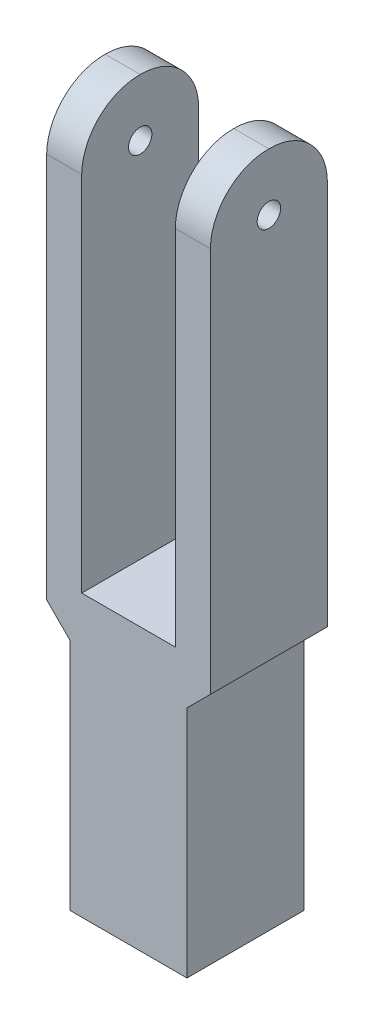
ISO-10303-21;
HEADER;
FILE_DESCRIPTION(('STEP AP214'),'2;1');
FILE_NAME('part.step','',(''),(''),'','','');
FILE_SCHEMA(('AUTOMOTIVE_DESIGN { 1 0 10303 214 1 1 1 1 }'));
ENDSEC;
DATA;
#1=APPLICATION_CONTEXT('core data for automotive mechanical design processes');
#2=APPLICATION_PROTOCOL_DEFINITION('international standard','automotive_design',2000,#1);
#3=PRODUCT_CONTEXT('',#1,'mechanical');
#4=PRODUCT('Part','Part','',(#3));
#5=PRODUCT_RELATED_PRODUCT_CATEGORY('part','',(#4));
#6=PRODUCT_DEFINITION_FORMATION('','',#4);
#7=PRODUCT_DEFINITION_CONTEXT('part definition',#1,'design');
#8=PRODUCT_DEFINITION('design','',#6,#7);
#9=PRODUCT_DEFINITION_SHAPE('','',#8);
#10=(LENGTH_UNIT() NAMED_UNIT(*) SI_UNIT(.MILLI.,.METRE.));
#11=(NAMED_UNIT(*) PLANE_ANGLE_UNIT() SI_UNIT($,.RADIAN.));
#12=(NAMED_UNIT(*) SI_UNIT($,.STERADIAN.) SOLID_ANGLE_UNIT());
#13=UNCERTAINTY_MEASURE_WITH_UNIT(LENGTH_MEASURE(1.E-05),#10,'distance_accuracy_value','');
#14=(GEOMETRIC_REPRESENTATION_CONTEXT(3) GLOBAL_UNCERTAINTY_ASSIGNED_CONTEXT((#13)) GLOBAL_UNIT_ASSIGNED_CONTEXT((#10,
#11,#12)) REPRESENTATION_CONTEXT('',''));
#15=CARTESIAN_POINT('',(0.,0.,0.));
#16=DIRECTION('',(0.,0.,1.));
#17=DIRECTION('',(1.,0.,0.));
#18=AXIS2_PLACEMENT_3D('',#15,#16,#17);
#19=CARTESIAN_POINT('',(3.5,30.,2.5));
#20=DIRECTION('',(-1.,0.,0.));
#21=DIRECTION('',(0.,0.,1.));
#22=AXIS2_PLACEMENT_3D('',#19,#20,#21);
#23=PLANE('',#22);
#24=CARTESIAN_POINT('',(3.5,27.5,0.));
#25=DIRECTION('',(1.,0.,0.));
#26=DIRECTION('',(0.,0.,-1.));
#27=AXIS2_PLACEMENT_3D('',#24,#25,#26);
#28=CIRCLE('',#27,0.5);
#29=CARTESIAN_POINT('',(3.5,27.5,-0.500000000000004));
#30=VERTEX_POINT('',#29);
#31=EDGE_CURVE('E447',#30,#30,#28,.T.);
#32=ORIENTED_EDGE('',*,*,#31,.F.);
#33=EDGE_LOOP('',(#32));
#34=FACE_BOUND('',#33,.T.);
#35=CARTESIAN_POINT('',(3.5,27.4738892377842,-0.0261107622158117));
#36=DIRECTION('',(-1.,0.,0.));
#37=DIRECTION('',(0.,0.,1.));
#38=AXIS2_PLACEMENT_3D('',#35,#36,#37);
#39=CIRCLE('',#38,2.47402702748535);
#40=CARTESIAN_POINT('',(3.5,29.9477784755684,0.));
#41=VERTEX_POINT('',#40);
#42=CARTESIAN_POINT('',(3.5,27.5,-2.50000000000001));
#43=VERTEX_POINT('',#42);
#44=EDGE_CURVE('E152',#41,#43,#39,.T.);
#45=ORIENTED_EDGE('',*,*,#44,.F.);
#46=CARTESIAN_POINT('',(3.5,27.4738892377841,0.0261107622157451));
#47=DIRECTION('',(-1.,0.,0.));
#48=DIRECTION('',(0.,0.,1.));
#49=AXIS2_PLACEMENT_3D('',#46,#47,#48);
#50=CIRCLE('',#49,2.4740270274854);
#51=CARTESIAN_POINT('',(3.5,27.5,2.5));
#52=VERTEX_POINT('',#51);
#53=EDGE_CURVE('E154',#52,#41,#50,.T.);
#54=ORIENTED_EDGE('',*,*,#53,.F.);
#55=DIRECTION('',(0.,-1.,0.));
#56=VECTOR('',#55,1.);
#57=CARTESIAN_POINT('',(3.5,30.,2.5));
#58=LINE('',#57,#56);
#59=CARTESIAN_POINT('',(3.5,11.,2.5));
#60=VERTEX_POINT('',#59);
#61=EDGE_CURVE('E236',#52,#60,#58,.T.);
#62=ORIENTED_EDGE('',*,*,#61,.T.);
#63=DIRECTION('',(0.,0.,1.));
#64=VECTOR('',#63,1.);
#65=CARTESIAN_POINT('',(3.5,11.,-2.501));
#66=LINE('',#65,#64);
#67=CARTESIAN_POINT('',(3.5,11.,-2.5));
#68=VERTEX_POINT('',#67);
#69=EDGE_CURVE('E174',#68,#60,#66,.T.);
#70=ORIENTED_EDGE('',*,*,#69,.F.);
#71=DIRECTION('',(0.,-1.,0.));
#72=VECTOR('',#71,1.);
#73=CARTESIAN_POINT('',(3.5,30.,-2.5));
#74=LINE('',#73,#72);
#75=EDGE_CURVE('E234',#43,#68,#74,.T.);
#76=ORIENTED_EDGE('',*,*,#75,.F.);
#77=EDGE_LOOP('',(#45,#54,#62,#70,#76));
#78=FACE_BOUND('',#77,.T.);
#79=ADVANCED_FACE('F32',(#34,#78),#23,.F.);
#80=CARTESIAN_POINT('',(-3.5,30.,2.5));
#81=DIRECTION('',(1.,0.,0.));
#82=DIRECTION('',(0.,0.,-1.));
#83=AXIS2_PLACEMENT_3D('',#80,#81,#82);
#84=PLANE('',#83);
#85=CARTESIAN_POINT('',(-3.5,27.5,0.));
#86=DIRECTION('',(1.,0.,0.));
#87=DIRECTION('',(0.,0.,-1.));
#88=AXIS2_PLACEMENT_3D('',#85,#86,#87);
#89=CIRCLE('',#88,0.5);
#90=CARTESIAN_POINT('',(-3.5,27.5,-0.500000000000004));
#91=VERTEX_POINT('',#90);
#92=EDGE_CURVE('E451',#91,#91,#89,.T.);
#93=ORIENTED_EDGE('',*,*,#92,.T.);
#94=EDGE_LOOP('',(#93));
#95=FACE_BOUND('',#94,.T.);
#96=DIRECTION('',(0.,-1.,0.));
#97=VECTOR('',#96,1.);
#98=CARTESIAN_POINT('',(-3.5,30.,2.5));
#99=LINE('',#98,#97);
#100=CARTESIAN_POINT('',(-3.5,27.5,2.5));
#101=VERTEX_POINT('',#100);
#102=CARTESIAN_POINT('',(-3.5,11.,2.5));
#103=VERTEX_POINT('',#102);
#104=EDGE_CURVE('E151',#101,#103,#99,.T.);
#105=ORIENTED_EDGE('',*,*,#104,.F.);
#106=CARTESIAN_POINT('',(-3.5,27.4738892377841,0.0261107622157451));
#107=DIRECTION('',(-1.,0.,0.));
#108=DIRECTION('',(0.,0.,1.));
#109=AXIS2_PLACEMENT_3D('',#106,#107,#108);
#110=CIRCLE('',#109,2.4740270274854);
#111=CARTESIAN_POINT('',(-3.5,29.9477784755684,0.));
#112=VERTEX_POINT('',#111);
#113=EDGE_CURVE('E134',#101,#112,#110,.T.);
#114=ORIENTED_EDGE('',*,*,#113,.T.);
#115=CARTESIAN_POINT('',(-3.5,27.4738892377842,-0.0261107622158117));
#116=DIRECTION('',(-1.,0.,0.));
#117=DIRECTION('',(0.,0.,1.));
#118=AXIS2_PLACEMENT_3D('',#115,#116,#117);
#119=CIRCLE('',#118,2.47402702748535);
#120=CARTESIAN_POINT('',(-3.5,27.5,-2.50000000000001));
#121=VERTEX_POINT('',#120);
#122=EDGE_CURVE('E142',#112,#121,#119,.T.);
#123=ORIENTED_EDGE('',*,*,#122,.T.);
#124=DIRECTION('',(0.,-1.,0.));
#125=VECTOR('',#124,1.);
#126=CARTESIAN_POINT('',(-3.5,30.,-2.5));
#127=LINE('',#126,#125);
#128=CARTESIAN_POINT('',(-3.5,11.,-2.5));
#129=VERTEX_POINT('',#128);
#130=EDGE_CURVE('E232',#121,#129,#127,.T.);
#131=ORIENTED_EDGE('',*,*,#130,.T.);
#132=DIRECTION('',(0.,0.,1.));
#133=VECTOR('',#132,1.);
#134=CARTESIAN_POINT('',(-3.5,11.,-2.501));
#135=LINE('',#134,#133);
#136=EDGE_CURVE('E182',#129,#103,#135,.T.);
#137=ORIENTED_EDGE('',*,*,#136,.T.);
#138=EDGE_LOOP('',(#105,#114,#123,#131,#137));
#139=FACE_BOUND('',#138,.T.);
#140=ADVANCED_FACE('F34',(#95,#139),#84,.F.);
#141=CARTESIAN_POINT('',(3.5,30.,2.5));
#142=DIRECTION('',(0.,0.,-1.));
#143=DIRECTION('',(-1.,0.,0.));
#144=AXIS2_PLACEMENT_3D('',#141,#142,#143);
#145=PLANE('',#144);
#146=ORIENTED_EDGE('',*,*,#61,.F.);
#147=DIRECTION('',(1.,0.,0.));
#148=VECTOR('',#147,1.);
#149=CARTESIAN_POINT('',(-3.5,27.5,2.5));
#150=LINE('',#149,#148);
#151=CARTESIAN_POINT('',(2.,27.5,2.5));
#152=VERTEX_POINT('',#151);
#153=EDGE_CURVE('E165',#152,#52,#150,.T.);
#154=ORIENTED_EDGE('',*,*,#153,.F.);
#155=DIRECTION('',(0.,1.,0.));
#156=VECTOR('',#155,1.);
#157=CARTESIAN_POINT('',(2.,12.,2.5));
#158=LINE('',#157,#156);
#159=CARTESIAN_POINT('',(2.,12.,2.5));
#160=VERTEX_POINT('',#159);
#161=EDGE_CURVE('E204',#160,#152,#158,.T.);
#162=ORIENTED_EDGE('',*,*,#161,.F.);
#163=DIRECTION('',(1.,0.,0.));
#164=VECTOR('',#163,1.);
#165=CARTESIAN_POINT('',(2.,12.,2.5));
#166=LINE('',#165,#164);
#167=CARTESIAN_POINT('',(-2.,12.,2.5));
#168=VERTEX_POINT('',#167);
#169=EDGE_CURVE('E187',#168,#160,#166,.T.);
#170=ORIENTED_EDGE('',*,*,#169,.F.);
#171=DIRECTION('',(0.,1.,0.));
#172=VECTOR('',#171,1.);
#173=CARTESIAN_POINT('',(-2.,12.,2.5));
#174=LINE('',#173,#172);
#175=CARTESIAN_POINT('',(-2.,27.5,2.5));
#176=VERTEX_POINT('',#175);
#177=EDGE_CURVE('E196',#168,#176,#174,.T.);
#178=ORIENTED_EDGE('',*,*,#177,.T.);
#179=EDGE_CURVE('E162',#101,#176,#150,.T.);
#180=ORIENTED_EDGE('',*,*,#179,.F.);
#181=ORIENTED_EDGE('',*,*,#104,.T.);
#182=DIRECTION('',(-0.707106781186548,0.707106781186547,0.));
#183=VECTOR('',#182,1.);
#184=CARTESIAN_POINT('',(-2.5,10.,2.5));
#185=LINE('',#184,#183);
#186=CARTESIAN_POINT('',(-2.5,10.,2.5));
#187=VERTEX_POINT('',#186);
#188=EDGE_CURVE('E179',#187,#103,#185,.T.);
#189=ORIENTED_EDGE('',*,*,#188,.F.);
#190=DIRECTION('',(0.,-1.,0.));
#191=VECTOR('',#190,1.);
#192=CARTESIAN_POINT('',(-2.5,10.,2.5));
#193=LINE('',#192,#191);
#194=CARTESIAN_POINT('',(-2.5,0.,2.5));
#195=VERTEX_POINT('',#194);
#196=EDGE_CURVE('E222',#187,#195,#193,.T.);
#197=ORIENTED_EDGE('',*,*,#196,.T.);
#198=DIRECTION('',(1.,0.,0.));
#199=VECTOR('',#198,1.);
#200=CARTESIAN_POINT('',(3.5,0.,2.5));
#201=LINE('',#200,#199);
#202=CARTESIAN_POINT('',(2.5,0.,2.5));
#203=VERTEX_POINT('',#202);
#204=EDGE_CURVE('E225',#195,#203,#201,.T.);
#205=ORIENTED_EDGE('',*,*,#204,.T.);
#206=DIRECTION('',(0.,-1.,0.));
#207=VECTOR('',#206,1.);
#208=CARTESIAN_POINT('',(2.5,10.,2.5));
#209=LINE('',#208,#207);
#210=CARTESIAN_POINT('',(2.5,10.,2.5));
#211=VERTEX_POINT('',#210);
#212=EDGE_CURVE('E211',#211,#203,#209,.T.);
#213=ORIENTED_EDGE('',*,*,#212,.F.);
#214=DIRECTION('',(-0.707106781186548,-0.707106781186547,0.));
#215=VECTOR('',#214,1.);
#216=CARTESIAN_POINT('',(2.5,10.,2.5));
#217=LINE('',#216,#215);
#218=EDGE_CURVE('E172',#60,#211,#217,.T.);
#219=ORIENTED_EDGE('',*,*,#218,.F.);
#220=EDGE_LOOP('',(#146,#154,#162,#170,#178,#180,#181,#189,#197,#205,#213,#219));
#221=FACE_BOUND('',#220,.T.);
#222=ADVANCED_FACE('F254',(#221),#145,.F.);
#223=CARTESIAN_POINT('',(3.5,30.,-2.5));
#224=DIRECTION('',(0.,0.,1.));
#225=DIRECTION('',(1.,0.,0.));
#226=AXIS2_PLACEMENT_3D('',#223,#224,#225);
#227=PLANE('',#226);
#228=ORIENTED_EDGE('',*,*,#130,.F.);
#229=DIRECTION('',(1.,0.,0.));
#230=VECTOR('',#229,1.);
#231=CARTESIAN_POINT('',(-3.5,27.5,-2.50000000000001));
#232=LINE('',#231,#230);
#233=CARTESIAN_POINT('',(-2.,27.5,-2.50000000000001));
#234=VERTEX_POINT('',#233);
#235=EDGE_CURVE('E145',#121,#234,#232,.T.);
#236=ORIENTED_EDGE('',*,*,#235,.T.);
#237=DIRECTION('',(0.,1.,0.));
#238=VECTOR('',#237,1.);
#239=CARTESIAN_POINT('',(-2.,12.,-2.5));
#240=LINE('',#239,#238);
#241=CARTESIAN_POINT('',(-2.,12.,-2.5));
#242=VERTEX_POINT('',#241);
#243=EDGE_CURVE('E197',#242,#234,#240,.T.);
#244=ORIENTED_EDGE('',*,*,#243,.F.);
#245=DIRECTION('',(-1.,0.,0.));
#246=VECTOR('',#245,1.);
#247=CARTESIAN_POINT('',(2.,12.,-2.5));
#248=LINE('',#247,#246);
#249=CARTESIAN_POINT('',(2.,12.,-2.5));
#250=VERTEX_POINT('',#249);
#251=EDGE_CURVE('E193',#250,#242,#248,.T.);
#252=ORIENTED_EDGE('',*,*,#251,.F.);
#253=DIRECTION('',(0.,1.,0.));
#254=VECTOR('',#253,1.);
#255=CARTESIAN_POINT('',(2.,12.,-2.5));
#256=LINE('',#255,#254);
#257=CARTESIAN_POINT('',(2.,27.500000000001,-2.5));
#258=VERTEX_POINT('',#257);
#259=EDGE_CURVE('E201',#250,#258,#256,.T.);
#260=ORIENTED_EDGE('',*,*,#259,.T.);
#261=EDGE_CURVE('E56',#258,#43,#232,.T.);
#262=ORIENTED_EDGE('',*,*,#261,.T.);
#263=ORIENTED_EDGE('',*,*,#75,.T.);
#264=DIRECTION('',(0.707106781186548,0.707106781186547,0.));
#265=VECTOR('',#264,1.);
#266=CARTESIAN_POINT('',(2.5,10.,-2.5));
#267=LINE('',#266,#265);
#268=CARTESIAN_POINT('',(2.5,10.,-2.5));
#269=VERTEX_POINT('',#268);
#270=EDGE_CURVE('E169',#269,#68,#267,.T.);
#271=ORIENTED_EDGE('',*,*,#270,.F.);
#272=DIRECTION('',(0.,-1.,0.));
#273=VECTOR('',#272,1.);
#274=CARTESIAN_POINT('',(2.5,10.,-2.5));
#275=LINE('',#274,#273);
#276=CARTESIAN_POINT('',(2.5,0.,-2.5));
#277=VERTEX_POINT('',#276);
#278=EDGE_CURVE('E213',#269,#277,#275,.T.);
#279=ORIENTED_EDGE('',*,*,#278,.T.);
#280=DIRECTION('',(-1.,0.,0.));
#281=VECTOR('',#280,1.);
#282=CARTESIAN_POINT('',(3.5,0.,-2.5));
#283=LINE('',#282,#281);
#284=CARTESIAN_POINT('',(-2.5,0.,-2.5));
#285=VERTEX_POINT('',#284);
#286=EDGE_CURVE('E230',#277,#285,#283,.T.);
#287=ORIENTED_EDGE('',*,*,#286,.T.);
#288=DIRECTION('',(0.,-1.,0.));
#289=VECTOR('',#288,1.);
#290=CARTESIAN_POINT('',(-2.5,10.,-2.5));
#291=LINE('',#290,#289);
#292=CARTESIAN_POINT('',(-2.5,10.,-2.5));
#293=VERTEX_POINT('',#292);
#294=EDGE_CURVE('E220',#293,#285,#291,.T.);
#295=ORIENTED_EDGE('',*,*,#294,.F.);
#296=DIRECTION('',(0.707106781186548,-0.707106781186547,0.));
#297=VECTOR('',#296,1.);
#298=CARTESIAN_POINT('',(-2.5,10.,-2.5));
#299=LINE('',#298,#297);
#300=EDGE_CURVE('E177',#129,#293,#299,.T.);
#301=ORIENTED_EDGE('',*,*,#300,.F.);
#302=EDGE_LOOP('',(#228,#236,#244,#252,#260,#262,#263,#271,#279,#287,#295,#301));
#303=FACE_BOUND('',#302,.T.);
#304=ADVANCED_FACE('F244',(#303),#227,.F.);
#305=CARTESIAN_POINT('',(-3.5,0.,-2.5));
#306=DIRECTION('',(0.,1.,0.));
#307=DIRECTION('',(0.,0.,1.));
#308=AXIS2_PLACEMENT_3D('',#305,#306,#307);
#309=PLANE('',#308);
#310=CARTESIAN_POINT('',(0.,0.,0.));
#311=DIRECTION('',(0.,-1.,0.));
#312=DIRECTION('',(0.,0.,-1.));
#313=AXIS2_PLACEMENT_3D('',#310,#311,#312);
#314=CIRCLE('',#313,1.);
#315=CARTESIAN_POINT('',(0.,0.,-1.));
#316=VERTEX_POINT('',#315);
#317=EDGE_CURVE('E448',#316,#316,#314,.T.);
#318=ORIENTED_EDGE('',*,*,#317,.F.);
#319=EDGE_LOOP('',(#318));
#320=FACE_BOUND('',#319,.T.);
#321=ORIENTED_EDGE('',*,*,#286,.F.);
#322=DIRECTION('',(0.,0.,-1.));
#323=VECTOR('',#322,1.);
#324=CARTESIAN_POINT('',(2.5,0.,2.5));
#325=LINE('',#324,#323);
#326=EDGE_CURVE('E200',#203,#277,#325,.T.);
#327=ORIENTED_EDGE('',*,*,#326,.F.);
#328=ORIENTED_EDGE('',*,*,#204,.F.);
#329=DIRECTION('',(0.,0.,1.));
#330=VECTOR('',#329,1.);
#331=CARTESIAN_POINT('',(-2.5,0.,2.5));
#332=LINE('',#331,#330);
#333=EDGE_CURVE('E216',#285,#195,#332,.T.);
#334=ORIENTED_EDGE('',*,*,#333,.F.);
#335=EDGE_LOOP('',(#321,#327,#328,#334));
#336=FACE_BOUND('',#335,.T.);
#337=ADVANCED_FACE('F291',(#320,#336),#309,.F.);
#338=CARTESIAN_POINT('',(-2.5,10.,2.5));
#339=DIRECTION('',(1.,0.,0.));
#340=DIRECTION('',(0.,0.,-1.));
#341=AXIS2_PLACEMENT_3D('',#338,#339,#340);
#342=PLANE('',#341);
#343=ORIENTED_EDGE('',*,*,#333,.T.);
#344=ORIENTED_EDGE('',*,*,#196,.F.);
#345=DIRECTION('',(0.,0.,1.));
#346=VECTOR('',#345,1.);
#347=CARTESIAN_POINT('',(-2.5,10.,2.5));
#348=LINE('',#347,#346);
#349=EDGE_CURVE('E218',#293,#187,#348,.T.);
#350=ORIENTED_EDGE('',*,*,#349,.F.);
#351=ORIENTED_EDGE('',*,*,#294,.T.);
#352=EDGE_LOOP('',(#343,#344,#350,#351));
#353=FACE_BOUND('',#352,.T.);
#354=ADVANCED_FACE('F295',(#353),#342,.F.);
#355=CARTESIAN_POINT('',(2.5,10.,2.5));
#356=DIRECTION('',(-1.,0.,0.));
#357=DIRECTION('',(0.,0.,1.));
#358=AXIS2_PLACEMENT_3D('',#355,#356,#357);
#359=PLANE('',#358);
#360=ORIENTED_EDGE('',*,*,#326,.T.);
#361=ORIENTED_EDGE('',*,*,#278,.F.);
#362=DIRECTION('',(0.,0.,-1.));
#363=VECTOR('',#362,1.);
#364=CARTESIAN_POINT('',(2.5,10.,2.5));
#365=LINE('',#364,#363);
#366=EDGE_CURVE('E209',#211,#269,#365,.T.);
#367=ORIENTED_EDGE('',*,*,#366,.F.);
#368=ORIENTED_EDGE('',*,*,#212,.T.);
#369=EDGE_LOOP('',(#360,#361,#367,#368));
#370=FACE_BOUND('',#369,.T.);
#371=ADVANCED_FACE('F300',(#370),#359,.F.);
#372=CARTESIAN_POINT('',(-2.,12.,2.5));
#373=DIRECTION('',(-1.,0.,0.));
#374=DIRECTION('',(0.,0.,1.));
#375=AXIS2_PLACEMENT_3D('',#372,#373,#374);
#376=PLANE('',#375);
#377=CARTESIAN_POINT('',(-2.,27.5,0.));
#378=DIRECTION('',(-1.,0.,0.));
#379=DIRECTION('',(0.,0.,1.));
#380=AXIS2_PLACEMENT_3D('',#377,#378,#379);
#381=CIRCLE('',#380,0.5);
#382=CARTESIAN_POINT('',(-2.,27.5,0.499999999999996));
#383=VERTEX_POINT('',#382);
#384=EDGE_CURVE('E157',#383,#383,#381,.T.);
#385=ORIENTED_EDGE('',*,*,#384,.T.);
#386=EDGE_LOOP('',(#385));
#387=FACE_BOUND('',#386,.T.);
#388=CARTESIAN_POINT('',(-2.,27.4738892377842,-0.0261107622158117));
#389=DIRECTION('',(-1.,0.,0.));
#390=DIRECTION('',(0.,0.,1.));
#391=AXIS2_PLACEMENT_3D('',#388,#389,#390);
#392=CIRCLE('',#391,2.47402702748535);
#393=CARTESIAN_POINT('',(-2.,29.9477784755684,0.));
#394=VERTEX_POINT('',#393);
#395=EDGE_CURVE('E164',#234,#394,#392,.F.);
#396=ORIENTED_EDGE('',*,*,#395,.T.);
#397=CARTESIAN_POINT('',(-2.,27.4738892377841,0.0261107622157451));
#398=DIRECTION('',(-1.,0.,0.));
#399=DIRECTION('',(0.,0.,1.));
#400=AXIS2_PLACEMENT_3D('',#397,#398,#399);
#401=CIRCLE('',#400,2.4740270274854);
#402=EDGE_CURVE('E137',#394,#176,#401,.F.);
#403=ORIENTED_EDGE('',*,*,#402,.T.);
#404=ORIENTED_EDGE('',*,*,#177,.F.);
#405=DIRECTION('',(0.,0.,1.));
#406=VECTOR('',#405,1.);
#407=CARTESIAN_POINT('',(-2.,12.,2.5));
#408=LINE('',#407,#406);
#409=EDGE_CURVE('E184',#242,#168,#408,.T.);
#410=ORIENTED_EDGE('',*,*,#409,.F.);
#411=ORIENTED_EDGE('',*,*,#243,.T.);
#412=EDGE_LOOP('',(#396,#403,#404,#410,#411));
#413=FACE_BOUND('',#412,.T.);
#414=ADVANCED_FACE('F308',(#387,#413),#376,.F.);
#415=CARTESIAN_POINT('',(2.,12.,2.5));
#416=DIRECTION('',(1.,0.,0.));
#417=DIRECTION('',(0.,0.,-1.));
#418=AXIS2_PLACEMENT_3D('',#415,#416,#417);
#419=PLANE('',#418);
#420=CARTESIAN_POINT('',(2.,27.5,0.));
#421=DIRECTION('',(1.,0.,0.));
#422=DIRECTION('',(0.,0.,-1.));
#423=AXIS2_PLACEMENT_3D('',#420,#421,#422);
#424=CIRCLE('',#423,0.5);
#425=CARTESIAN_POINT('',(2.,27.5,-0.500000000000004));
#426=VERTEX_POINT('',#425);
#427=EDGE_CURVE('E36',#426,#426,#424,.T.);
#428=ORIENTED_EDGE('',*,*,#427,.T.);
#429=EDGE_LOOP('',(#428));
#430=FACE_BOUND('',#429,.T.);
#431=ORIENTED_EDGE('',*,*,#161,.T.);
#432=CARTESIAN_POINT('',(2.,27.4738892377841,0.0261107622157451));
#433=DIRECTION('',(1.,0.,0.));
#434=DIRECTION('',(0.,0.,-1.));
#435=AXIS2_PLACEMENT_3D('',#432,#433,#434);
#436=CIRCLE('',#435,2.4740270274854);
#437=CARTESIAN_POINT('',(2.,29.9477784755684,0.));
#438=VERTEX_POINT('',#437);
#439=EDGE_CURVE('E11',#152,#438,#436,.F.);
#440=ORIENTED_EDGE('',*,*,#439,.T.);
#441=CARTESIAN_POINT('',(2.,27.4738892377842,-0.0261107622158117));
#442=DIRECTION('',(1.,0.,0.));
#443=DIRECTION('',(0.,0.,-1.));
#444=AXIS2_PLACEMENT_3D('',#441,#442,#443);
#445=CIRCLE('',#444,2.47402702748535);
#446=EDGE_CURVE('E41',#438,#258,#445,.F.);
#447=ORIENTED_EDGE('',*,*,#446,.T.);
#448=ORIENTED_EDGE('',*,*,#259,.F.);
#449=DIRECTION('',(0.,0.,-1.));
#450=VECTOR('',#449,1.);
#451=CARTESIAN_POINT('',(2.,12.,2.5));
#452=LINE('',#451,#450);
#453=EDGE_CURVE('E190',#160,#250,#452,.T.);
#454=ORIENTED_EDGE('',*,*,#453,.F.);
#455=EDGE_LOOP('',(#431,#440,#447,#448,#454));
#456=FACE_BOUND('',#455,.T.);
#457=ADVANCED_FACE('F240',(#430,#456),#419,.F.);
#458=CARTESIAN_POINT('',(-2.,12.,-2.5));
#459=DIRECTION('',(0.,1.,0.));
#460=DIRECTION('',(0.,0.,1.));
#461=AXIS2_PLACEMENT_3D('',#458,#459,#460);
#462=PLANE('',#461);
#463=ORIENTED_EDGE('',*,*,#409,.T.);
#464=ORIENTED_EDGE('',*,*,#169,.T.);
#465=ORIENTED_EDGE('',*,*,#453,.T.);
#466=ORIENTED_EDGE('',*,*,#251,.T.);
#467=EDGE_LOOP('',(#463,#464,#465,#466));
#468=FACE_BOUND('',#467,.T.);
#469=ADVANCED_FACE('F248',(#468),#462,.T.);
#470=CARTESIAN_POINT('',(-2.5,10.,-2.501));
#471=DIRECTION('',(0.707106781186547,0.707106781186548,0.));
#472=DIRECTION('',(-0.707106781186548,0.707106781186547,0.));
#473=AXIS2_PLACEMENT_3D('',#470,#471,#472);
#474=PLANE('',#473);
#475=ORIENTED_EDGE('',*,*,#300,.T.);
#476=ORIENTED_EDGE('',*,*,#349,.T.);
#477=ORIENTED_EDGE('',*,*,#188,.T.);
#478=ORIENTED_EDGE('',*,*,#136,.F.);
#479=EDGE_LOOP('',(#475,#476,#477,#478));
#480=FACE_BOUND('',#479,.T.);
#481=ADVANCED_FACE('F271',(#480),#474,.F.);
#482=CARTESIAN_POINT('',(2.5,10.,-2.501));
#483=DIRECTION('',(-0.707106781186547,0.707106781186548,0.));
#484=DIRECTION('',(-0.707106781186548,-0.707106781186547,0.));
#485=AXIS2_PLACEMENT_3D('',#482,#483,#484);
#486=PLANE('',#485);
#487=ORIENTED_EDGE('',*,*,#270,.T.);
#488=ORIENTED_EDGE('',*,*,#69,.T.);
#489=ORIENTED_EDGE('',*,*,#218,.T.);
#490=ORIENTED_EDGE('',*,*,#366,.T.);
#491=EDGE_LOOP('',(#487,#488,#489,#490));
#492=FACE_BOUND('',#491,.T.);
#493=ADVANCED_FACE('F264',(#492),#486,.F.);
#494=CARTESIAN_POINT('',(-3.5,27.4738892377842,-0.0261107622158117));
#495=DIRECTION('',(1.,0.,0.));
#496=DIRECTION('',(0.,0.,-1.));
#497=AXIS2_PLACEMENT_3D('',#494,#495,#496);
#498=CYLINDRICAL_SURFACE('',#497,2.47402702748535);
#499=DIRECTION('',(1.,0.,0.));
#500=VECTOR('',#499,1.);
#501=CARTESIAN_POINT('',(-3.5,29.9477784755684,0.));
#502=LINE('',#501,#500);
#503=EDGE_CURVE('E139',#438,#41,#502,.T.);
#504=ORIENTED_EDGE('',*,*,#503,.T.);
#505=ORIENTED_EDGE('',*,*,#44,.T.);
#506=ORIENTED_EDGE('',*,*,#261,.F.);
#507=ORIENTED_EDGE('',*,*,#446,.F.);
#508=EDGE_LOOP('',(#504,#505,#506,#507));
#509=FACE_BOUND('',#508,.T.);
#510=ADVANCED_FACE('F262',(#509),#498,.T.);
#511=CARTESIAN_POINT('',(-3.5,27.4738892377841,0.0261107622157451));
#512=DIRECTION('',(1.,0.,0.));
#513=DIRECTION('',(0.,0.,-1.));
#514=AXIS2_PLACEMENT_3D('',#511,#512,#513);
#515=CYLINDRICAL_SURFACE('',#514,2.4740270274854);
#516=ORIENTED_EDGE('',*,*,#153,.T.);
#517=ORIENTED_EDGE('',*,*,#53,.T.);
#518=ORIENTED_EDGE('',*,*,#503,.F.);
#519=ORIENTED_EDGE('',*,*,#439,.F.);
#520=EDGE_LOOP('',(#516,#517,#518,#519));
#521=FACE_BOUND('',#520,.T.);
#522=ADVANCED_FACE('F258',(#521),#515,.T.);
#523=EDGE_CURVE('E48',#112,#394,#502,.T.);
#524=ORIENTED_EDGE('',*,*,#523,.F.);
#525=ORIENTED_EDGE('',*,*,#113,.F.);
#526=ORIENTED_EDGE('',*,*,#179,.T.);
#527=ORIENTED_EDGE('',*,*,#402,.F.);
#528=EDGE_LOOP('',(#524,#525,#526,#527));
#529=FACE_BOUND('',#528,.T.);
#530=ADVANCED_FACE('F132',(#529),#515,.T.);
#531=ORIENTED_EDGE('',*,*,#235,.F.);
#532=ORIENTED_EDGE('',*,*,#122,.F.);
#533=ORIENTED_EDGE('',*,*,#523,.T.);
#534=ORIENTED_EDGE('',*,*,#395,.F.);
#535=EDGE_LOOP('',(#531,#532,#533,#534));
#536=FACE_BOUND('',#535,.T.);
#537=ADVANCED_FACE('F143',(#536),#498,.T.);
#538=CARTESIAN_POINT('',(-3.5,27.5,0.));
#539=DIRECTION('',(1.,0.,0.));
#540=DIRECTION('',(0.,0.,-1.));
#541=AXIS2_PLACEMENT_3D('',#538,#539,#540);
#542=CYLINDRICAL_SURFACE('',#541,0.5);
#543=ORIENTED_EDGE('',*,*,#31,.T.);
#544=EDGE_LOOP('',(#543));
#545=FACE_BOUND('',#544,.T.);
#546=ORIENTED_EDGE('',*,*,#427,.F.);
#547=EDGE_LOOP('',(#546));
#548=FACE_BOUND('',#547,.T.);
#549=ADVANCED_FACE('F276',(#545,#548),#542,.F.);
#550=ORIENTED_EDGE('',*,*,#92,.F.);
#551=EDGE_LOOP('',(#550));
#552=FACE_BOUND('',#551,.T.);
#553=ORIENTED_EDGE('',*,*,#384,.F.);
#554=EDGE_LOOP('',(#553));
#555=FACE_BOUND('',#554,.T.);
#556=ADVANCED_FACE('F335',(#552,#555),#542,.F.);
#557=CARTESIAN_POINT('',(0.,10.,0.));
#558=DIRECTION('',(0.,-1.,0.));
#559=DIRECTION('',(0.,0.,-1.));
#560=AXIS2_PLACEMENT_3D('',#557,#558,#559);
#561=CYLINDRICAL_SURFACE('',#560,1.);
#562=CARTESIAN_POINT('',(0.,10.,0.));
#563=DIRECTION('',(0.,-1.,0.));
#564=DIRECTION('',(0.,0.,-1.));
#565=AXIS2_PLACEMENT_3D('',#562,#563,#564);
#566=CIRCLE('',#565,1.);
#567=CARTESIAN_POINT('',(0.,10.,-1.));
#568=VERTEX_POINT('',#567);
#569=EDGE_CURVE('E446',#568,#568,#566,.T.);
#570=ORIENTED_EDGE('',*,*,#569,.F.);
#571=EDGE_LOOP('',(#570));
#572=FACE_BOUND('',#571,.T.);
#573=ORIENTED_EDGE('',*,*,#317,.T.);
#574=EDGE_LOOP('',(#573));
#575=FACE_BOUND('',#574,.T.);
#576=ADVANCED_FACE('F343',(#572,#575),#561,.F.);
#577=CARTESIAN_POINT('',(0.,10.,0.));
#578=DIRECTION('',(0.,-1.,0.));
#579=DIRECTION('',(0.,0.,-1.));
#580=AXIS2_PLACEMENT_3D('',#577,#578,#579);
#581=PLANE('',#580);
#582=ORIENTED_EDGE('',*,*,#569,.T.);
#583=EDGE_LOOP('',(#582));
#584=FACE_BOUND('',#583,.T.);
#585=ADVANCED_FACE('F350',(#584),#581,.T.);
#586=CLOSED_SHELL('',(#79,#140,#222,#304,#337,#354,#371,#414,#457,#469,#481,#493,#510,#522,#530,
#537,#549,#556,#576,#585));
#587=MANIFOLD_SOLID_BREP('B2',#586);
#588=ADVANCED_BREP_SHAPE_REPRESENTATION('',(#18,#587),#14);
#589=SHAPE_DEFINITION_REPRESENTATION(#9,#588);
ENDSEC;
END-ISO-10303-21;
